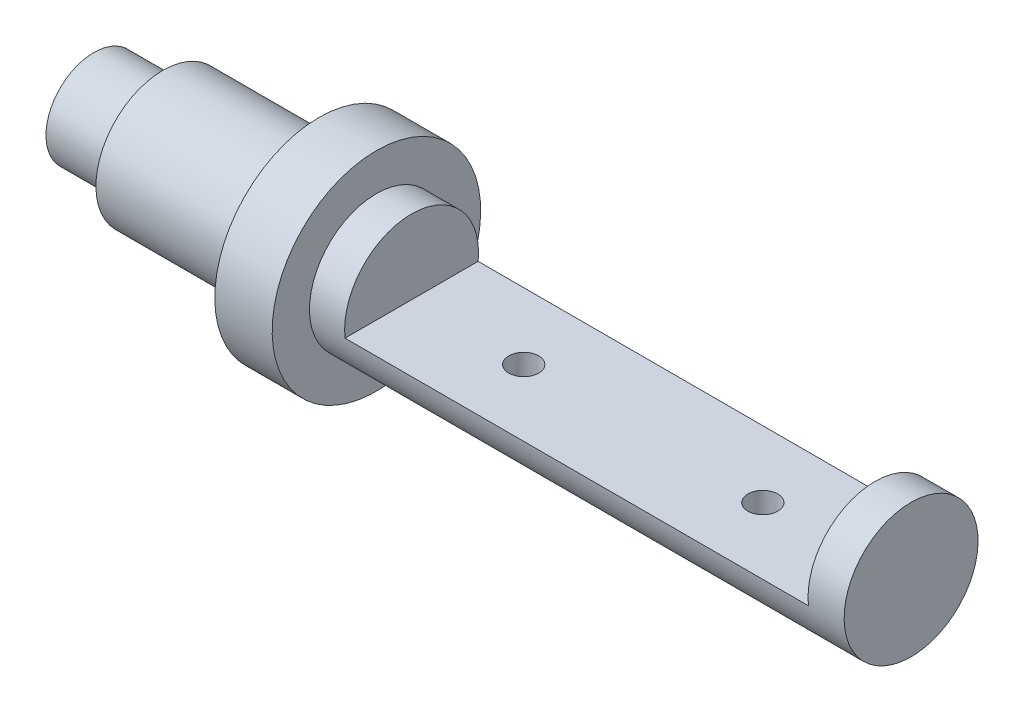
ISO-10303-21;
HEADER;
FILE_DESCRIPTION(('STEP AP214'),'2;1');
FILE_NAME('part.step','',(''),(''),'','','');
FILE_SCHEMA(('AUTOMOTIVE_DESIGN { 1 0 10303 214 1 1 1 1 }'));
ENDSEC;
DATA;
#1=APPLICATION_CONTEXT('core data for automotive mechanical design processes');
#2=APPLICATION_PROTOCOL_DEFINITION('international standard','automotive_design',2000,#1);
#3=PRODUCT_CONTEXT('',#1,'mechanical');
#4=PRODUCT('Part','Part','',(#3));
#5=PRODUCT_RELATED_PRODUCT_CATEGORY('part','',(#4));
#6=PRODUCT_DEFINITION_FORMATION('','',#4);
#7=PRODUCT_DEFINITION_CONTEXT('part definition',#1,'design');
#8=PRODUCT_DEFINITION('design','',#6,#7);
#9=PRODUCT_DEFINITION_SHAPE('','',#8);
#10=(LENGTH_UNIT() NAMED_UNIT(*) SI_UNIT(.MILLI.,.METRE.));
#11=(NAMED_UNIT(*) PLANE_ANGLE_UNIT() SI_UNIT($,.RADIAN.));
#12=(NAMED_UNIT(*) SI_UNIT($,.STERADIAN.) SOLID_ANGLE_UNIT());
#13=UNCERTAINTY_MEASURE_WITH_UNIT(LENGTH_MEASURE(1.E-05),#10,'distance_accuracy_value','');
#14=(GEOMETRIC_REPRESENTATION_CONTEXT(3) GLOBAL_UNCERTAINTY_ASSIGNED_CONTEXT((#13)) GLOBAL_UNIT_ASSIGNED_CONTEXT((#10,
#11,#12)) REPRESENTATION_CONTEXT('',''));
#15=CARTESIAN_POINT('',(0.,0.,0.));
#16=DIRECTION('',(0.,0.,1.));
#17=DIRECTION('',(1.,0.,0.));
#18=AXIS2_PLACEMENT_3D('',#15,#16,#17);
#19=CARTESIAN_POINT('',(132.9,-3.10000000000004,-43.6));
#20=DIRECTION('',(0.,-1.,0.));
#21=DIRECTION('',(0.,0.,-1.));
#22=AXIS2_PLACEMENT_3D('',#19,#20,#21);
#23=PLANE('',#22);
#24=CARTESIAN_POINT('',(279.8,-3.10000000000004,0.));
#25=DIRECTION('',(0.,1.,0.));
#26=DIRECTION('',(0.,0.,1.));
#27=AXIS2_PLACEMENT_3D('',#24,#25,#26);
#28=CIRCLE('',#27,6.25000000000003);
#29=CARTESIAN_POINT('',(279.8,-3.10000000000004,6.25000000000003));
#30=VERTEX_POINT('',#29);
#31=EDGE_CURVE('E141',#30,#30,#28,.T.);
#32=ORIENTED_EDGE('',*,*,#31,.F.);
#33=EDGE_LOOP('',(#32));
#34=FACE_BOUND('',#33,.T.);
#35=DIRECTION('',(0.,0.,1.));
#36=VECTOR('',#35,1.);
#37=CARTESIAN_POINT('',(132.9,-3.10000000000004,-43.6));
#38=LINE('',#37,#36);
#39=CARTESIAN_POINT('',(132.9,-3.10000000000004,-27.8278637340346));
#40=VERTEX_POINT('',#39);
#41=CARTESIAN_POINT('',(132.9,-3.10000000000004,27.8278637340346));
#42=VERTEX_POINT('',#41);
#43=EDGE_CURVE('E60',#40,#42,#38,.T.);
#44=ORIENTED_EDGE('',*,*,#43,.T.);
#45=DIRECTION('',(1.,0.,0.));
#46=VECTOR('',#45,1.);
#47=CARTESIAN_POINT('',(341.8,-3.10000000000004,27.8278637340346));
#48=LINE('',#47,#46);
#49=CARTESIAN_POINT('',(326.7,-3.10000000000004,27.8278637340346));
#50=VERTEX_POINT('',#49);
#51=EDGE_CURVE('E78',#50,#42,#48,.F.);
#52=ORIENTED_EDGE('',*,*,#51,.F.);
#53=DIRECTION('',(0.,0.,1.));
#54=VECTOR('',#53,1.);
#55=CARTESIAN_POINT('',(326.7,-3.10000000000004,-43.6));
#56=LINE('',#55,#54);
#57=CARTESIAN_POINT('',(326.7,-3.10000000000004,-27.8278637340346));
#58=VERTEX_POINT('',#57);
#59=EDGE_CURVE('E76',#58,#50,#56,.T.);
#60=ORIENTED_EDGE('',*,*,#59,.F.);
#61=DIRECTION('',(1.,0.,0.));
#62=VECTOR('',#61,1.);
#63=CARTESIAN_POINT('',(341.8,-3.10000000000004,-27.8278637340346));
#64=LINE('',#63,#62);
#65=EDGE_CURVE('E12',#40,#58,#64,.T.);
#66=ORIENTED_EDGE('',*,*,#65,.F.);
#67=EDGE_LOOP('',(#44,#52,#60,#66));
#68=FACE_BOUND('',#67,.T.);
#69=CARTESIAN_POINT('',(179.8,-3.10000000000004,0.));
#70=DIRECTION('',(0.,1.,0.));
#71=DIRECTION('',(0.,0.,1.));
#72=AXIS2_PLACEMENT_3D('',#69,#70,#71);
#73=CIRCLE('',#72,6.25000000000001);
#74=CARTESIAN_POINT('',(179.8,-3.10000000000004,6.25000000000001));
#75=VERTEX_POINT('',#74);
#76=EDGE_CURVE('E161',#75,#75,#73,.T.);
#77=ORIENTED_EDGE('',*,*,#76,.F.);
#78=EDGE_LOOP('',(#77));
#79=FACE_BOUND('',#78,.T.);
#80=ADVANCED_FACE('F44',(#34,#68,#79),#23,.F.);
#81=CARTESIAN_POINT('',(341.8,0.,0.));
#82=DIRECTION('',(-1.,0.,0.));
#83=DIRECTION('',(0.,-1.,0.));
#84=AXIS2_PLACEMENT_3D('',#81,#82,#83);
#85=PLANE('',#84);
#86=CARTESIAN_POINT('',(341.8,0.,0.));
#87=DIRECTION('',(1.,0.,0.));
#88=DIRECTION('',(0.,1.,0.));
#89=AXIS2_PLACEMENT_3D('',#86,#87,#88);
#90=CIRCLE('',#89,28.);
#91=CARTESIAN_POINT('',(341.8,28.,0.));
#92=VERTEX_POINT('',#91);
#93=EDGE_CURVE('E94',#92,#92,#90,.T.);
#94=ORIENTED_EDGE('',*,*,#93,.T.);
#95=EDGE_LOOP('',(#94));
#96=FACE_BOUND('',#95,.T.);
#97=ADVANCED_FACE('F46',(#96),#85,.F.);
#98=CARTESIAN_POINT('',(341.8,0.,0.));
#99=DIRECTION('',(1.,0.,0.));
#100=DIRECTION('',(0.,1.,0.));
#101=AXIS2_PLACEMENT_3D('',#98,#99,#100);
#102=CYLINDRICAL_SURFACE('',#101,28.);
#103=CARTESIAN_POINT('',(179.8,-27.2935431924842,6.25000000000001));
#104=CARTESIAN_POINT('',(179.973227240131,-27.2935406630598,6.25000418094473));
#105=CARTESIAN_POINT('',(180.146405416123,-27.295195294476,6.24279659776609));
#106=CARTESIAN_POINT('',(180.491554795079,-27.3017584796593,6.21403440350836));
#107=CARTESIAN_POINT('',(180.6635258188,-27.3066675067386,6.19247770552276));
#108=CARTESIAN_POINT('',(181.005036985319,-27.3195986301188,6.13517608334991));
#109=CARTESIAN_POINT('',(181.174576041898,-27.3276220751525,6.09942501198107));
#110=CARTESIAN_POINT('',(181.510014716781,-27.3465464155528,6.01400967245121));
#111=CARTESIAN_POINT('',(181.675912968207,-27.3574483722472,5.96434027208898));
#112=CARTESIAN_POINT('',(182.00260176081,-27.3817905916842,5.85156924300111));
#113=CARTESIAN_POINT('',(182.163399653823,-27.3952269869803,5.78848806167799));
#114=CARTESIAN_POINT('',(182.479120960692,-27.4242678496656,5.64929956777816));
#115=CARTESIAN_POINT('',(182.634042180069,-27.4398731170088,5.57318744653335));
#116=CARTESIAN_POINT('',(182.936860324114,-27.4728000717142,5.40853934345902));
#117=CARTESIAN_POINT('',(183.084760060108,-27.4901210633972,5.3200083911139));
#118=CARTESIAN_POINT('',(183.372695192458,-27.5260101395213,5.13108281812593));
#119=CARTESIAN_POINT('',(183.512727613821,-27.5445786899706,5.03068375356069));
#120=CARTESIAN_POINT('',(183.786064464647,-27.5827411710545,4.81708795276358));
#121=CARTESIAN_POINT('',(183.919231611053,-27.6023465077546,4.70371753740179));
#122=CARTESIAN_POINT('',(184.175632397061,-27.6417727676251,4.46619442991225));
#123=CARTESIAN_POINT('',(184.298862334099,-27.6615937680575,4.34203775433225));
#124=CARTESIAN_POINT('',(184.534476757656,-27.700889474895,4.08384197537747));
#125=CARTESIAN_POINT('',(184.646864328051,-27.7203642784753,3.94980570128881));
#126=CARTESIAN_POINT('',(184.860106258016,-27.7584430824459,3.67265674935638));
#127=CARTESIAN_POINT('',(184.960956353239,-27.7770467593695,3.52954074575632));
#128=CARTESIAN_POINT('',(185.151375435379,-27.813052346094,3.23365995739579));
#129=CARTESIAN_POINT('',(185.240813044513,-27.8304393713552,3.08080874634003));
#130=CARTESIAN_POINT('',(185.406502071587,-27.8633050823482,2.76785167600484));
#131=CARTESIAN_POINT('',(185.482748526262,-27.8787830491572,2.60774311456666));
#132=CARTESIAN_POINT('',(185.621393827613,-27.9073737582623,2.28150107379453));
#133=CARTESIAN_POINT('',(185.683799065753,-27.9204875917193,2.11537041669152));
#134=CARTESIAN_POINT('',(185.79432439497,-27.9439896454641,1.77823756423971));
#135=CARTESIAN_POINT('',(185.842439323739,-27.9543768806238,1.60723363283176));
#136=CARTESIAN_POINT('',(185.963305994625,-27.9806601200355,1.09439758323677));
#137=CARTESIAN_POINT('',(186.015011516578,-27.9921960538676,0.746994222027693));
#138=CARTESIAN_POINT('',(186.048465338978,-27.9996585490208,0.223520525139102));
#139=CARTESIAN_POINT('',(186.052258570274,-28.0005041840466,0.0485642360946091));
#140=CARTESIAN_POINT('',(186.045191028428,-27.9989265851301,-0.301058844425873));
#141=CARTESIAN_POINT('',(186.034330051152,-27.9965033056516,-0.475725631835143));
#142=CARTESIAN_POINT('',(185.980445022773,-27.9845298925051,-0.991080970449483));
#143=CARTESIAN_POINT('',(185.916523023973,-27.970364519702,-1.32971272514976));
#144=CARTESIAN_POINT('',(185.734283623065,-27.9310839487509,-1.99113945055509));
#145=CARTESIAN_POINT('',(185.615963695635,-27.9059682422566,-2.31393368526245));
#146=CARTESIAN_POINT('',(185.327386306443,-27.8472521946706,-2.93758195962187));
#147=CARTESIAN_POINT('',(185.156742751696,-27.813589111637,-3.23825157149131));
#148=CARTESIAN_POINT('',(184.768651355419,-27.7414625355303,-3.80704732566784));
#149=CARTESIAN_POINT('',(184.551196892033,-27.7029983636206,-4.07516885533362));
#150=CARTESIAN_POINT('',(184.070075316537,-27.6245113562129,-4.57738580559882));
#151=CARTESIAN_POINT('',(183.805509313808,-27.5844728055815,-4.81061849864796));
#152=CARTESIAN_POINT('',(183.240604280735,-27.5081274935843,-5.22957036099763));
#153=CARTESIAN_POINT('',(182.940264197972,-27.4718208420637,-5.41528813197722));
#154=CARTESIAN_POINT('',(182.31090167033,-27.4070063654905,-5.73434528879875));
#155=CARTESIAN_POINT('',(181.981790749875,-27.3785237986947,-5.86751562740583));
#156=CARTESIAN_POINT('',(181.305073727676,-27.3329281069129,-6.0763962250565));
#157=CARTESIAN_POINT('',(180.957470705158,-27.3158130954113,-6.15211601866804));
#158=CARTESIAN_POINT('',(180.261536530252,-27.2952766976966,-6.24259542089443));
#159=CARTESIAN_POINT('',(179.913377205227,-27.291572561069,-6.25861396727173));
#160=CARTESIAN_POINT('',(179.219362733582,-27.2975136372092,-6.23264970129105));
#161=CARTESIAN_POINT('',(178.873507423352,-27.3071578917232,-6.1906710524346));
#162=CARTESIAN_POINT('',(178.198341212884,-27.3384415167486,-6.05099829572651));
#163=CARTESIAN_POINT('',(177.868878146797,-27.3599303668854,-5.95400289682964));
#164=CARTESIAN_POINT('',(177.230880438804,-27.4123452195023,-5.70780773520875));
#165=CARTESIAN_POINT('',(176.922347871527,-27.4432721558189,-5.558602806482));
#166=CARTESIAN_POINT('',(176.329537846567,-27.5116960387506,-5.20947386615225));
#167=CARTESIAN_POINT('',(176.045726760959,-27.5492900747217,-5.00877748022631));
#168=CARTESIAN_POINT('',(175.515346199917,-27.6265592430673,-4.56335143969625));
#169=CARTESIAN_POINT('',(175.268781558386,-27.6662346446661,-4.31861607865891));
#170=CARTESIAN_POINT('',(174.81499533107,-27.7441297258463,-3.78641602648043));
#171=CARTESIAN_POINT('',(174.60863407886,-27.7823059698252,-3.49821158905156));
#172=CARTESIAN_POINT('',(174.247208238456,-27.8520981732881,-2.89029963896414));
#173=CARTESIAN_POINT('',(174.092141203496,-27.8837144456601,-2.57059362989548));
#174=CARTESIAN_POINT('',(173.902112280185,-27.9234467514472,-2.07570333708503));
#175=CARTESIAN_POINT('',(173.845961830884,-27.9353862929346,-1.90866854996698));
#176=CARTESIAN_POINT('',(173.747925802913,-27.9564443638961,-1.5703062834102));
#177=CARTESIAN_POINT('',(173.706034930717,-27.9655639400989,-1.39898042234163));
#178=CARTESIAN_POINT('',(173.636866059754,-27.9807181181667,-1.05326831573392));
#179=CARTESIAN_POINT('',(173.609589076211,-27.986752505703,-0.878881858444736));
#180=CARTESIAN_POINT('',(173.569875265287,-27.9955635060913,-0.528347318502384));
#181=CARTESIAN_POINT('',(173.557437844618,-27.9983402491843,-0.352199306560329));
#182=CARTESIAN_POINT('',(173.547617295144,-28.0005315872801,-0.00328258899926477));
#183=CARTESIAN_POINT('',(173.549914239453,-28.0000176335598,0.169476763448736));
#184=CARTESIAN_POINT('',(173.568794747477,-27.995809223028,0.514171279855257));
#185=CARTESIAN_POINT('',(173.585378020058,-27.9921148310289,0.686106460537336));
#186=CARTESIAN_POINT('',(173.632699110862,-27.9816470037884,1.02794898351234));
#187=CARTESIAN_POINT('',(173.663439159492,-27.9748730833677,1.19785600193809));
#188=CARTESIAN_POINT('',(173.738813501217,-27.9584357777394,1.53435186906264));
#189=CARTESIAN_POINT('',(173.783442852505,-27.9487734202847,1.70094187555776));
#190=CARTESIAN_POINT('',(173.88608666388,-27.9268574568711,2.0291887293845));
#191=CARTESIAN_POINT('',(173.944058450613,-27.9146121223051,2.19085948233514));
#192=CARTESIAN_POINT('',(174.073003385431,-27.8878471112107,2.50866639727834));
#193=CARTESIAN_POINT('',(174.143971963358,-27.8733282344044,2.66480448180282));
#194=CARTESIAN_POINT('',(174.298440230493,-27.8423945526457,2.97063998638385));
#195=CARTESIAN_POINT('',(174.381945246875,-27.825978942391,3.12033463343335));
#196=CARTESIAN_POINT('',(174.560846668197,-27.7916988602937,3.41219288944287));
#197=CARTESIAN_POINT('',(174.656239058201,-27.7738348783443,3.55435901815252));
#198=CARTESIAN_POINT('',(174.860319323447,-27.7367568229686,3.8330774015288));
#199=CARTESIAN_POINT('',(174.969235418031,-27.7175228620527,3.96945995543578));
#200=CARTESIAN_POINT('',(175.198007097279,-27.67856827949,4.23255724998559));
#201=CARTESIAN_POINT('',(175.317858879234,-27.6588478287394,4.35927532336926));
#202=CARTESIAN_POINT('',(175.567809302254,-27.6194442852869,4.60233284521468));
#203=CARTESIAN_POINT('',(175.697914044197,-27.5997612220746,4.71866602514744));
#204=CARTESIAN_POINT('',(175.967397981406,-27.5609972321727,4.94004645388395));
#205=CARTESIAN_POINT('',(176.106773770864,-27.5419160881187,5.0450978104982));
#206=CARTESIAN_POINT('',(176.396004828618,-27.5046146614129,5.24467646780602));
#207=CARTESIAN_POINT('',(176.545982532296,-27.4864108262582,5.33902953184628));
#208=CARTESIAN_POINT('',(176.853497779292,-27.4517038520394,5.51470510633684));
#209=CARTESIAN_POINT('',(177.011032510596,-27.4352000874544,5.59603241561453));
#210=CARTESIAN_POINT('',(177.332540718847,-27.4043843599853,5.74504238460735));
#211=CARTESIAN_POINT('',(177.496510680403,-27.3900712207976,5.81273237339837));
#212=CARTESIAN_POINT('',(177.82974114241,-27.364060344737,5.93397254806087));
#213=CARTESIAN_POINT('',(177.999000706799,-27.3523621480711,5.987525220039));
#214=CARTESIAN_POINT('',(178.435288736739,-27.3263643748796,6.10534932009698));
#215=CARTESIAN_POINT('',(178.705243724371,-27.3141314337926,6.15951030297509));
#216=CARTESIAN_POINT('',(179.250173824552,-27.2977230622745,6.2318313742948));
#217=CARTESIAN_POINT('',(179.525148670884,-27.2935472058001,6.24999336629612));
#218=CARTESIAN_POINT('',(179.8,-27.2935431924842,6.25000000000001));
#219=B_SPLINE_CURVE_WITH_KNOTS('',3,(#103,#104,#105,#106,#107,#108,#109,#110,#111,#112,#113,
#114,#115,#116,#117,#118,#119,#120,#121,#122,#123,#124,#125,#126,#127,#128,#129,#130,#131,#132,
#133,#134,#135,#136,#137,#138,#139,#140,#141,#142,#143,#144,#145,#146,#147,#148,#149,#150,#151,
#152,#153,#154,#155,#156,#157,#158,#159,#160,#161,#162,#163,#164,#165,#166,#167,#168,#169,#170,
#171,#172,#173,#174,#175,#176,#177,#178,#179,#180,#181,#182,#183,#184,#185,#186,#187,#188,#189,
#190,#191,#192,#193,#194,#195,#196,#197,#198,#199,#200,#201,#202,#203,#204,#205,#206,#207,#208,
#209,#210,#211,#212,#213,#214,#215,#216,#217,#218),.UNSPECIFIED.,.T.,.F.,(4,2,2,2,2,2,2,2,2,2,2,
2,2,2,2,2,2,2,2,2,2,2,2,2,2,2,2,2,2,2,2,2,2,2,2,2,2,2,2,2,2,2,2,2,2,2,2,2,2,2,2,2,2,2,2,2,2,4),
(0.,0.519439608500139,1.0389547797675,1.55869518419964,2.07862748884636,2.59777272482057,
3.1171099499522,3.63623745343965,4.1555599596157,4.68290174643604,5.21043911948483,
5.73782600077029,6.26540718315176,6.79859906273959,7.33199112529032,7.86513636801499,
8.39847397341277,9.44659898859371,9.97108019976339,10.4955687170816,11.5250017072293,
12.5544824917318,13.5917504134608,14.6291651632887,15.6890487552905,16.7489635351156,
17.8122608342571,18.8753816285583,19.9159529707268,20.9564496162611,21.9840187566687,
23.0116896012437,24.0557822772237,25.10001034103,26.1645877935077,27.229114457624,
27.7584522517355,28.2875933270914,28.8167711569939,29.3459278295956,29.8636344148691,
30.3813304503266,30.8991080770091,31.4167016888243,31.9326623270648,32.4484418813475,
32.9644412321529,33.4802667751747,34.0064342303606,34.5324194115064,35.0587199707588,
35.5848282449849,36.1185476697549,36.6520700120354,37.1853048551527,37.7184458641198,
38.542659288208,39.3668291282598),.UNSPECIFIED.);
#220=CARTESIAN_POINT('',(179.8,-27.2935431924842,6.25000000000001));
#221=VERTEX_POINT('',#220);
#222=EDGE_CURVE('E154',#221,#221,#219,.T.);
#223=ORIENTED_EDGE('',*,*,#222,.T.);
#224=EDGE_LOOP('',(#223));
#225=FACE_BOUND('',#224,.T.);
#226=CARTESIAN_POINT('',(279.8,-27.2935431924841,6.25000000000003));
#227=CARTESIAN_POINT('',(279.973227240131,-27.2935406630598,6.25000418094476));
#228=CARTESIAN_POINT('',(280.146405416123,-27.295195294476,6.24279659776612));
#229=CARTESIAN_POINT('',(280.491554795079,-27.3017584796593,6.21403440350839));
#230=CARTESIAN_POINT('',(280.6635258188,-27.3066675067385,6.19247770552278));
#231=CARTESIAN_POINT('',(281.005036985319,-27.3195986301188,6.13517608334994));
#232=CARTESIAN_POINT('',(281.174576041898,-27.3276220751525,6.09942501198109));
#233=CARTESIAN_POINT('',(281.510014716781,-27.3465464155528,6.01400967245124));
#234=CARTESIAN_POINT('',(281.675912968207,-27.3574483722472,5.964340272089));
#235=CARTESIAN_POINT('',(282.00260176081,-27.3817905916842,5.85156924300113));
#236=CARTESIAN_POINT('',(282.163399653823,-27.3952269869803,5.788488061678));
#237=CARTESIAN_POINT('',(282.479120960692,-27.4242678496656,5.64929956777816));
#238=CARTESIAN_POINT('',(282.634042180069,-27.4398731170088,5.57318744653336));
#239=CARTESIAN_POINT('',(282.936860324114,-27.4728000717142,5.40853934345903));
#240=CARTESIAN_POINT('',(283.084760060108,-27.4901210633972,5.32000839111392));
#241=CARTESIAN_POINT('',(283.372695192458,-27.5260101395213,5.13108281812594));
#242=CARTESIAN_POINT('',(283.512727613821,-27.5445786899706,5.0306837535607));
#243=CARTESIAN_POINT('',(283.786064464647,-27.5827411710545,4.81708795276359));
#244=CARTESIAN_POINT('',(283.919231611053,-27.6023465077546,4.70371753740181));
#245=CARTESIAN_POINT('',(284.175632397061,-27.6417727676251,4.46619442991226));
#246=CARTESIAN_POINT('',(284.298862334099,-27.6615937680575,4.34203775433225));
#247=CARTESIAN_POINT('',(284.534476757656,-27.700889474895,4.08384197537745));
#248=CARTESIAN_POINT('',(284.646864328051,-27.7203642784753,3.94980570128878));
#249=CARTESIAN_POINT('',(284.860106258017,-27.7584430824459,3.67265674935634));
#250=CARTESIAN_POINT('',(284.960956353239,-27.7770467593695,3.52954074575628));
#251=CARTESIAN_POINT('',(285.151375435379,-27.813052346094,3.23365995739575));
#252=CARTESIAN_POINT('',(285.240813044513,-27.8304393713552,3.08080874633998));
#253=CARTESIAN_POINT('',(285.406502071588,-27.8633050823482,2.76785167600478));
#254=CARTESIAN_POINT('',(285.482748526262,-27.8787830491572,2.60774311456661));
#255=CARTESIAN_POINT('',(285.621393827613,-27.9073737582623,2.28150107379449));
#256=CARTESIAN_POINT('',(285.683799065753,-27.9204875917193,2.11537041669148));
#257=CARTESIAN_POINT('',(285.79432439497,-27.9439896454641,1.77823756423967));
#258=CARTESIAN_POINT('',(285.842439323739,-27.9543768806238,1.60723363283171));
#259=CARTESIAN_POINT('',(285.963305994625,-27.9806601200355,1.09439758323672));
#260=CARTESIAN_POINT('',(286.015011516578,-27.9921960538676,0.746994222027645));
#261=CARTESIAN_POINT('',(286.048465338978,-27.9996585490208,0.223520525139056));
#262=CARTESIAN_POINT('',(286.052258570274,-28.0005041840466,0.0485642360945634));
#263=CARTESIAN_POINT('',(286.045191028428,-27.9989265851301,-0.301058844425918));
#264=CARTESIAN_POINT('',(286.034330051152,-27.9965033056516,-0.475725631835186));
#265=CARTESIAN_POINT('',(285.980445022773,-27.9845298925051,-0.991080970449529));
#266=CARTESIAN_POINT('',(285.916523023973,-27.970364519702,-1.32971272514981));
#267=CARTESIAN_POINT('',(285.734283623065,-27.9310839487509,-1.99113945055514));
#268=CARTESIAN_POINT('',(285.615963695635,-27.9059682422566,-2.31393368526251));
#269=CARTESIAN_POINT('',(285.327386306443,-27.8472521946706,-2.93758195962193));
#270=CARTESIAN_POINT('',(285.156742751696,-27.813589111637,-3.23825157149137));
#271=CARTESIAN_POINT('',(284.768651355419,-27.7414625355303,-3.80704732566789));
#272=CARTESIAN_POINT('',(284.551196892033,-27.7029983636205,-4.07516885533368));
#273=CARTESIAN_POINT('',(284.070075316537,-27.6245113562129,-4.57738580559887));
#274=CARTESIAN_POINT('',(283.805509313808,-27.5844728055815,-4.810618498648));
#275=CARTESIAN_POINT('',(283.240604280735,-27.5081274935843,-5.22957036099767));
#276=CARTESIAN_POINT('',(282.940264197972,-27.4718208420637,-5.41528813197726));
#277=CARTESIAN_POINT('',(282.31090167033,-27.4070063654905,-5.73434528879879));
#278=CARTESIAN_POINT('',(281.981790749875,-27.3785237986947,-5.86751562740589));
#279=CARTESIAN_POINT('',(281.305073727676,-27.3329281069129,-6.07639622505655));
#280=CARTESIAN_POINT('',(280.957470705158,-27.3158130954113,-6.15211601866808));
#281=CARTESIAN_POINT('',(280.261536530251,-27.2952766976966,-6.24259542089446));
#282=CARTESIAN_POINT('',(279.913377205227,-27.291572561069,-6.25861396727175));
#283=CARTESIAN_POINT('',(279.219362733582,-27.2975136372092,-6.23264970129107));
#284=CARTESIAN_POINT('',(278.873507423352,-27.3071578917232,-6.19067105243462));
#285=CARTESIAN_POINT('',(278.198341212884,-27.3384415167486,-6.05099829572653));
#286=CARTESIAN_POINT('',(277.868878146797,-27.3599303668854,-5.95400289682966));
#287=CARTESIAN_POINT('',(277.230880438804,-27.4123452195023,-5.70780773520876));
#288=CARTESIAN_POINT('',(276.922347871527,-27.4432721558189,-5.558602806482));
#289=CARTESIAN_POINT('',(276.329537846567,-27.5116960387506,-5.20947386615224));
#290=CARTESIAN_POINT('',(276.045726760959,-27.5492900747217,-5.0087774802263));
#291=CARTESIAN_POINT('',(275.515346199917,-27.6265592430673,-4.56335143969626));
#292=CARTESIAN_POINT('',(275.268781558386,-27.6662346446661,-4.31861607865893));
#293=CARTESIAN_POINT('',(274.81499533107,-27.7441297258463,-3.78641602648045));
#294=CARTESIAN_POINT('',(274.60863407886,-27.7823059698252,-3.49821158905157));
#295=CARTESIAN_POINT('',(274.247208238456,-27.8520981732881,-2.89029963896413));
#296=CARTESIAN_POINT('',(274.092141203496,-27.8837144456601,-2.57059362989545));
#297=CARTESIAN_POINT('',(273.902112280184,-27.9234467514472,-2.07570333708499));
#298=CARTESIAN_POINT('',(273.845961830884,-27.9353862929346,-1.90866854996694));
#299=CARTESIAN_POINT('',(273.747925802913,-27.9564443638961,-1.57030628341015));
#300=CARTESIAN_POINT('',(273.706034930717,-27.9655639400989,-1.39898042234159));
#301=CARTESIAN_POINT('',(273.636866059754,-27.9807181181667,-1.05326831573389));
#302=CARTESIAN_POINT('',(273.609589076211,-27.986752505703,-0.878881858444693));
#303=CARTESIAN_POINT('',(273.569875265287,-27.9955635060913,-0.528347318502335));
#304=CARTESIAN_POINT('',(273.557437844618,-27.9983402491843,-0.352199306560281));
#305=CARTESIAN_POINT('',(273.547617295144,-28.0005315872801,-0.00328258899921479));
#306=CARTESIAN_POINT('',(273.549914239453,-28.0000176335598,0.169476763448788));
#307=CARTESIAN_POINT('',(273.568794747477,-27.995809223028,0.514171279855311));
#308=CARTESIAN_POINT('',(273.585378020058,-27.9921148310289,0.68610646053739));
#309=CARTESIAN_POINT('',(273.632699110862,-27.9816470037884,1.0279489835124));
#310=CARTESIAN_POINT('',(273.663439159492,-27.9748730833677,1.19785600193815));
#311=CARTESIAN_POINT('',(273.738813501217,-27.9584357777394,1.5343518690627));
#312=CARTESIAN_POINT('',(273.783442852505,-27.9487734202847,1.70094187555782));
#313=CARTESIAN_POINT('',(273.88608666388,-27.9268574568711,2.02918872938455));
#314=CARTESIAN_POINT('',(273.944058450612,-27.9146121223051,2.19085948233519));
#315=CARTESIAN_POINT('',(274.073003385431,-27.8878471112107,2.50866639727838));
#316=CARTESIAN_POINT('',(274.143971963358,-27.8733282344044,2.66480448180286));
#317=CARTESIAN_POINT('',(274.298440230493,-27.8423945526457,2.9706399863839));
#318=CARTESIAN_POINT('',(274.381945246875,-27.825978942391,3.12033463343342));
#319=CARTESIAN_POINT('',(274.560846668197,-27.7916988602937,3.41219288944294));
#320=CARTESIAN_POINT('',(274.656239058201,-27.7738348783443,3.55435901815257));
#321=CARTESIAN_POINT('',(274.860319323447,-27.7367568229686,3.83307740152884));
#322=CARTESIAN_POINT('',(274.96923541803,-27.7175228620527,3.96945995543581));
#323=CARTESIAN_POINT('',(275.198007097279,-27.67856827949,4.23255724998563));
#324=CARTESIAN_POINT('',(275.317858879234,-27.6588478287394,4.35927532336931));
#325=CARTESIAN_POINT('',(275.567809302254,-27.6194442852869,4.60233284521472));
#326=CARTESIAN_POINT('',(275.697914044197,-27.5997612220746,4.71866602514746));
#327=CARTESIAN_POINT('',(275.967397981406,-27.5609972321727,4.94004645388398));
#328=CARTESIAN_POINT('',(276.106773770864,-27.5419160881187,5.04509781049825));
#329=CARTESIAN_POINT('',(276.396004828618,-27.5046146614129,5.24467646780607));
#330=CARTESIAN_POINT('',(276.545982532296,-27.4864108262582,5.33902953184632));
#331=CARTESIAN_POINT('',(276.853497779292,-27.4517038520394,5.51470510633688));
#332=CARTESIAN_POINT('',(277.011032510596,-27.4352000874544,5.59603241561456));
#333=CARTESIAN_POINT('',(277.332540718847,-27.4043843599853,5.74504238460739));
#334=CARTESIAN_POINT('',(277.496510680403,-27.3900712207976,5.81273237339841));
#335=CARTESIAN_POINT('',(277.82974114241,-27.364060344737,5.93397254806092));
#336=CARTESIAN_POINT('',(277.9990007068,-27.3523621480711,5.98752522003905));
#337=CARTESIAN_POINT('',(278.435288736739,-27.3263643748796,6.10534932009701));
#338=CARTESIAN_POINT('',(278.705243724371,-27.3141314337926,6.15951030297512));
#339=CARTESIAN_POINT('',(279.250173824552,-27.2977230622745,6.23183137429483));
#340=CARTESIAN_POINT('',(279.525148670884,-27.2935472058001,6.24999336629615));
#341=CARTESIAN_POINT('',(279.8,-27.2935431924841,6.25000000000003));
#342=B_SPLINE_CURVE_WITH_KNOTS('',3,(#226,#227,#228,#229,#230,#231,#232,#233,#234,#235,#236,
#237,#238,#239,#240,#241,#242,#243,#244,#245,#246,#247,#248,#249,#250,#251,#252,#253,#254,#255,
#256,#257,#258,#259,#260,#261,#262,#263,#264,#265,#266,#267,#268,#269,#270,#271,#272,#273,#274,
#275,#276,#277,#278,#279,#280,#281,#282,#283,#284,#285,#286,#287,#288,#289,#290,#291,#292,#293,
#294,#295,#296,#297,#298,#299,#300,#301,#302,#303,#304,#305,#306,#307,#308,#309,#310,#311,#312,
#313,#314,#315,#316,#317,#318,#319,#320,#321,#322,#323,#324,#325,#326,#327,#328,#329,#330,#331,
#332,#333,#334,#335,#336,#337,#338,#339,#340,#341),.UNSPECIFIED.,.T.,.F.,(4,2,2,2,2,2,2,2,2,2,2,
2,2,2,2,2,2,2,2,2,2,2,2,2,2,2,2,2,2,2,2,2,2,2,2,2,2,2,2,2,2,2,2,2,2,2,2,2,2,2,2,2,2,2,2,2,2,4),
(0.,0.519439608500166,1.03895477976747,1.55869518419967,2.07862748884639,2.5977727248206,
3.11710994995223,3.63623745343966,4.1555599596157,4.68290174643609,5.2104391194849,
5.73782600077037,6.26540718315184,6.79859906273972,7.33199112529039,7.86513636801506,
8.39847397341286,9.44659898859379,9.97108019976347,10.4955687170817,11.5250017072294,
12.5544824917319,13.5917504134609,14.6291651632888,15.6890487552906,16.7489635351157,
17.8122608342572,18.8753816285585,19.9159529707269,20.9564496162613,21.9840187566688,
23.0116896012439,24.0557822772238,25.1000103410301,26.1645877935078,27.2291144576241,
27.7584522517357,28.2875933270915,28.8167711569941,29.3459278295958,29.8636344148693,
30.3813304503268,30.8991080770093,31.4167016888245,31.932662327065,32.4484418813476,
32.964441232153,33.4802667751749,34.0064342303608,34.5324194115066,35.058719970759,
35.5848282449851,36.1185476697551,36.6520700120356,37.1853048551529,37.71844586412,
38.5426592882082,39.3668291282599),.UNSPECIFIED.);
#343=CARTESIAN_POINT('',(279.8,-27.2935431924841,6.25000000000003));
#344=VERTEX_POINT('',#343);
#345=EDGE_CURVE('E131',#344,#344,#342,.T.);
#346=ORIENTED_EDGE('',*,*,#345,.T.);
#347=EDGE_LOOP('',(#346));
#348=FACE_BOUND('',#347,.T.);
#349=ORIENTED_EDGE('',*,*,#65,.T.);
#350=CARTESIAN_POINT('',(326.7,0.,0.));
#351=DIRECTION('',(1.,0.,0.));
#352=DIRECTION('',(0.,0.,-1.));
#353=AXIS2_PLACEMENT_3D('',#350,#351,#352);
#354=CIRCLE('',#353,28.);
#355=EDGE_CURVE('E73',#58,#50,#354,.T.);
#356=ORIENTED_EDGE('',*,*,#355,.T.);
#357=ORIENTED_EDGE('',*,*,#51,.T.);
#358=CARTESIAN_POINT('',(132.9,0.,0.));
#359=DIRECTION('',(-1.,0.,0.));
#360=DIRECTION('',(0.,0.,1.));
#361=AXIS2_PLACEMENT_3D('',#358,#359,#360);
#362=CIRCLE('',#361,28.);
#363=EDGE_CURVE('E53',#42,#40,#362,.T.);
#364=ORIENTED_EDGE('',*,*,#363,.T.);
#365=EDGE_LOOP('',(#349,#356,#357,#364));
#366=FACE_BOUND('',#365,.T.);
#367=ORIENTED_EDGE('',*,*,#93,.F.);
#368=EDGE_LOOP('',(#367));
#369=FACE_BOUND('',#368,.T.);
#370=CARTESIAN_POINT('',(118.2,0.,0.));
#371=DIRECTION('',(1.,0.,0.));
#372=DIRECTION('',(0.,1.,0.));
#373=AXIS2_PLACEMENT_3D('',#370,#371,#372);
#374=CIRCLE('',#373,28.);
#375=CARTESIAN_POINT('',(118.2,28.,0.));
#376=VERTEX_POINT('',#375);
#377=EDGE_CURVE('E97',#376,#376,#374,.T.);
#378=ORIENTED_EDGE('',*,*,#377,.T.);
#379=EDGE_LOOP('',(#378));
#380=FACE_BOUND('',#379,.T.);
#381=ADVANCED_FACE('F84',(#225,#348,#366,#369,#380),#102,.T.);
#382=CARTESIAN_POINT('',(118.2,0.,0.));
#383=DIRECTION('',(1.,0.,0.));
#384=DIRECTION('',(0.,1.,0.));
#385=AXIS2_PLACEMENT_3D('',#382,#383,#384);
#386=PLANE('',#385);
#387=CARTESIAN_POINT('',(118.2,0.,0.));
#388=DIRECTION('',(1.,0.,0.));
#389=DIRECTION('',(0.,1.,0.));
#390=AXIS2_PLACEMENT_3D('',#387,#388,#389);
#391=CIRCLE('',#390,43.6);
#392=CARTESIAN_POINT('',(118.2,43.6,0.));
#393=VERTEX_POINT('',#392);
#394=EDGE_CURVE('E100',#393,#393,#391,.T.);
#395=ORIENTED_EDGE('',*,*,#394,.T.);
#396=EDGE_LOOP('',(#395));
#397=FACE_BOUND('',#396,.T.);
#398=ORIENTED_EDGE('',*,*,#377,.F.);
#399=EDGE_LOOP('',(#398));
#400=FACE_BOUND('',#399,.T.);
#401=ADVANCED_FACE('F87',(#397,#400),#386,.T.);
#402=CARTESIAN_POINT('',(341.8,0.,0.));
#403=DIRECTION('',(1.,0.,0.));
#404=DIRECTION('',(0.,1.,0.));
#405=AXIS2_PLACEMENT_3D('',#402,#403,#404);
#406=CYLINDRICAL_SURFACE('',#405,43.6);
#407=CARTESIAN_POINT('',(94.2,0.,0.));
#408=DIRECTION('',(1.,0.,0.));
#409=DIRECTION('',(0.,1.,0.));
#410=AXIS2_PLACEMENT_3D('',#407,#408,#409);
#411=CIRCLE('',#410,43.6);
#412=CARTESIAN_POINT('',(94.2,43.6,0.));
#413=VERTEX_POINT('',#412);
#414=EDGE_CURVE('E106',#413,#413,#411,.T.);
#415=ORIENTED_EDGE('',*,*,#414,.T.);
#416=EDGE_LOOP('',(#415));
#417=FACE_BOUND('',#416,.T.);
#418=ORIENTED_EDGE('',*,*,#394,.F.);
#419=EDGE_LOOP('',(#418));
#420=FACE_BOUND('',#419,.T.);
#421=ADVANCED_FACE('F196',(#417,#420),#406,.T.);
#422=CARTESIAN_POINT('',(94.2,0.,0.));
#423=DIRECTION('',(-1.,0.,0.));
#424=DIRECTION('',(0.,-1.,0.));
#425=AXIS2_PLACEMENT_3D('',#422,#423,#424);
#426=PLANE('',#425);
#427=CARTESIAN_POINT('',(94.2,0.,0.));
#428=DIRECTION('',(1.,0.,0.));
#429=DIRECTION('',(0.,1.,0.));
#430=AXIS2_PLACEMENT_3D('',#427,#428,#429);
#431=CIRCLE('',#430,28.);
#432=CARTESIAN_POINT('',(94.2,28.,0.));
#433=VERTEX_POINT('',#432);
#434=EDGE_CURVE('E115',#433,#433,#431,.T.);
#435=ORIENTED_EDGE('',*,*,#434,.T.);
#436=EDGE_LOOP('',(#435));
#437=FACE_BOUND('',#436,.T.);
#438=ORIENTED_EDGE('',*,*,#414,.F.);
#439=EDGE_LOOP('',(#438));
#440=FACE_BOUND('',#439,.T.);
#441=ADVANCED_FACE('F192',(#437,#440),#426,.T.);
#442=ORIENTED_EDGE('',*,*,#434,.F.);
#443=EDGE_LOOP('',(#442));
#444=FACE_BOUND('',#443,.T.);
#445=CARTESIAN_POINT('',(28.9,0.,0.));
#446=DIRECTION('',(1.,0.,0.));
#447=DIRECTION('',(0.,1.,0.));
#448=AXIS2_PLACEMENT_3D('',#445,#446,#447);
#449=CIRCLE('',#448,28.);
#450=CARTESIAN_POINT('',(28.9,28.,0.));
#451=VERTEX_POINT('',#450);
#452=EDGE_CURVE('E119',#451,#451,#449,.T.);
#453=ORIENTED_EDGE('',*,*,#452,.T.);
#454=EDGE_LOOP('',(#453));
#455=FACE_BOUND('',#454,.T.);
#456=ADVANCED_FACE('F90',(#444,#455),#102,.T.);
#457=CARTESIAN_POINT('',(28.9,0.,0.));
#458=DIRECTION('',(1.,0.,0.));
#459=DIRECTION('',(0.,1.,0.));
#460=AXIS2_PLACEMENT_3D('',#457,#458,#459);
#461=PLANE('',#460);
#462=ORIENTED_EDGE('',*,*,#452,.F.);
#463=EDGE_LOOP('',(#462));
#464=FACE_BOUND('',#463,.T.);
#465=CARTESIAN_POINT('',(28.9,0.,0.));
#466=DIRECTION('',(1.,0.,0.));
#467=DIRECTION('',(0.,1.,0.));
#468=AXIS2_PLACEMENT_3D('',#465,#466,#467);
#469=CIRCLE('',#468,20.);
#470=CARTESIAN_POINT('',(28.9,20.,0.));
#471=VERTEX_POINT('',#470);
#472=EDGE_CURVE('E123',#471,#471,#469,.T.);
#473=ORIENTED_EDGE('',*,*,#472,.T.);
#474=EDGE_LOOP('',(#473));
#475=FACE_BOUND('',#474,.T.);
#476=ADVANCED_FACE('F186',(#464,#475),#461,.F.);
#477=CARTESIAN_POINT('',(341.8,0.,0.));
#478=DIRECTION('',(1.,0.,0.));
#479=DIRECTION('',(0.,1.,0.));
#480=AXIS2_PLACEMENT_3D('',#477,#478,#479);
#481=CYLINDRICAL_SURFACE('',#480,20.);
#482=ORIENTED_EDGE('',*,*,#472,.F.);
#483=EDGE_LOOP('',(#482));
#484=FACE_BOUND('',#483,.T.);
#485=CARTESIAN_POINT('',(0.,0.,0.));
#486=DIRECTION('',(1.,0.,0.));
#487=DIRECTION('',(0.,1.,0.));
#488=AXIS2_PLACEMENT_3D('',#485,#486,#487);
#489=CIRCLE('',#488,20.);
#490=CARTESIAN_POINT('',(0.,20.,0.));
#491=VERTEX_POINT('',#490);
#492=EDGE_CURVE('E82',#491,#491,#489,.T.);
#493=ORIENTED_EDGE('',*,*,#492,.T.);
#494=EDGE_LOOP('',(#493));
#495=FACE_BOUND('',#494,.T.);
#496=ADVANCED_FACE('F182',(#484,#495),#481,.T.);
#497=CARTESIAN_POINT('',(0.,0.,0.));
#498=DIRECTION('',(1.,0.,0.));
#499=DIRECTION('',(0.,1.,0.));
#500=AXIS2_PLACEMENT_3D('',#497,#498,#499);
#501=PLANE('',#500);
#502=ORIENTED_EDGE('',*,*,#492,.F.);
#503=EDGE_LOOP('',(#502));
#504=FACE_BOUND('',#503,.T.);
#505=ADVANCED_FACE('F178',(#504),#501,.F.);
#506=CARTESIAN_POINT('',(132.9,28.,-43.6));
#507=DIRECTION('',(-1.,0.,0.));
#508=DIRECTION('',(0.,0.,1.));
#509=AXIS2_PLACEMENT_3D('',#506,#507,#508);
#510=PLANE('',#509);
#511=ORIENTED_EDGE('',*,*,#363,.F.);
#512=ORIENTED_EDGE('',*,*,#43,.F.);
#513=EDGE_LOOP('',(#511,#512));
#514=FACE_BOUND('',#513,.T.);
#515=ADVANCED_FACE('F175',(#514),#510,.F.);
#516=CARTESIAN_POINT('',(326.7,28.,-43.6));
#517=DIRECTION('',(1.,0.,0.));
#518=DIRECTION('',(0.,0.,-1.));
#519=AXIS2_PLACEMENT_3D('',#516,#517,#518);
#520=PLANE('',#519);
#521=ORIENTED_EDGE('',*,*,#355,.F.);
#522=ORIENTED_EDGE('',*,*,#59,.T.);
#523=EDGE_LOOP('',(#521,#522));
#524=FACE_BOUND('',#523,.T.);
#525=ADVANCED_FACE('F75',(#524),#520,.F.);
#526=CARTESIAN_POINT('',(279.8,-3.10000000000004,0.));
#527=DIRECTION('',(0.,1.,0.));
#528=DIRECTION('',(0.,0.,1.));
#529=AXIS2_PLACEMENT_3D('',#526,#527,#528);
#530=CYLINDRICAL_SURFACE('',#529,6.25000000000003);
#531=ORIENTED_EDGE('',*,*,#345,.F.);
#532=EDGE_LOOP('',(#531));
#533=FACE_BOUND('',#532,.T.);
#534=ORIENTED_EDGE('',*,*,#31,.T.);
#535=EDGE_LOOP('',(#534));
#536=FACE_BOUND('',#535,.T.);
#537=ADVANCED_FACE('F145',(#533,#536),#530,.F.);
#538=CARTESIAN_POINT('',(179.8,-3.10000000000004,0.));
#539=DIRECTION('',(0.,1.,0.));
#540=DIRECTION('',(0.,0.,1.));
#541=AXIS2_PLACEMENT_3D('',#538,#539,#540);
#542=CYLINDRICAL_SURFACE('',#541,6.25000000000001);
#543=ORIENTED_EDGE('',*,*,#222,.F.);
#544=EDGE_LOOP('',(#543));
#545=FACE_BOUND('',#544,.T.);
#546=ORIENTED_EDGE('',*,*,#76,.T.);
#547=EDGE_LOOP('',(#546));
#548=FACE_BOUND('',#547,.T.);
#549=ADVANCED_FACE('F149',(#545,#548),#542,.F.);
#550=CLOSED_SHELL('',(#80,#97,#381,#401,#421,#441,#456,#476,#496,#505,#515,#525,#537,#549));
#551=MANIFOLD_SOLID_BREP('B2',#550);
#552=ADVANCED_BREP_SHAPE_REPRESENTATION('',(#18,#551),#14);
#553=SHAPE_DEFINITION_REPRESENTATION(#9,#552);
ENDSEC;
END-ISO-10303-21;
